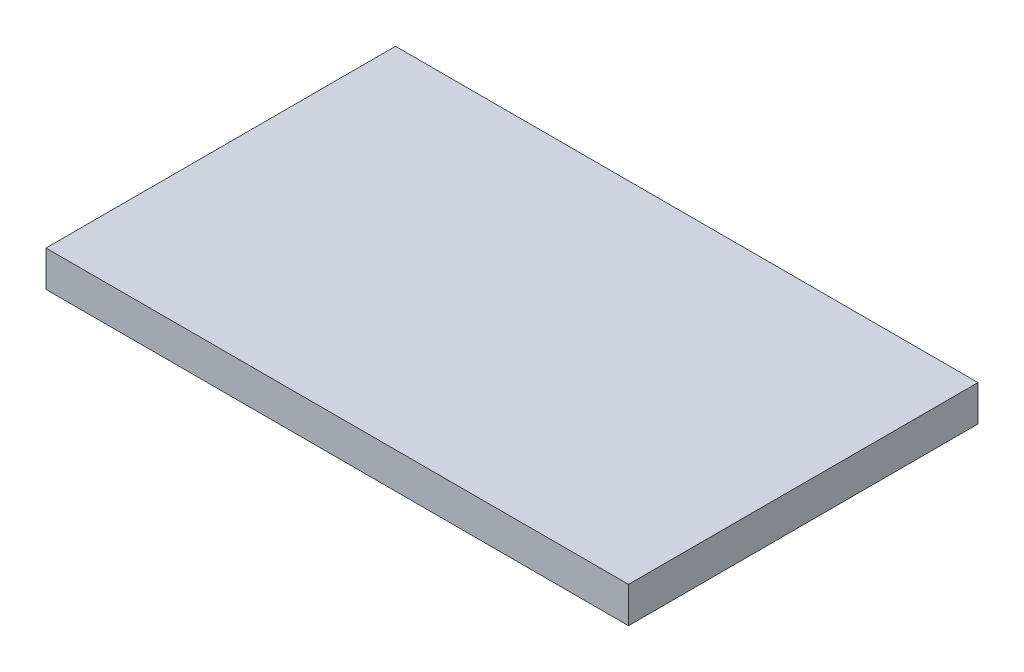
ISO-10303-21;
HEADER;
FILE_DESCRIPTION(('STEP AP214'),'2;1');
FILE_NAME('part.step','',(''),(''),'','','');
FILE_SCHEMA(('AUTOMOTIVE_DESIGN { 1 0 10303 214 1 1 1 1 }'));
ENDSEC;
DATA;
#1=APPLICATION_CONTEXT('core data for automotive mechanical design processes');
#2=APPLICATION_PROTOCOL_DEFINITION('international standard','automotive_design',2000,#1);
#3=PRODUCT_CONTEXT('',#1,'mechanical');
#4=PRODUCT('Part','Part','',(#3));
#5=PRODUCT_RELATED_PRODUCT_CATEGORY('part','',(#4));
#6=PRODUCT_DEFINITION_FORMATION('','',#4);
#7=PRODUCT_DEFINITION_CONTEXT('part definition',#1,'design');
#8=PRODUCT_DEFINITION('design','',#6,#7);
#9=PRODUCT_DEFINITION_SHAPE('','',#8);
#10=(LENGTH_UNIT() NAMED_UNIT(*) SI_UNIT(.MILLI.,.METRE.));
#11=(NAMED_UNIT(*) PLANE_ANGLE_UNIT() SI_UNIT($,.RADIAN.));
#12=(NAMED_UNIT(*) SI_UNIT($,.STERADIAN.) SOLID_ANGLE_UNIT());
#13=UNCERTAINTY_MEASURE_WITH_UNIT(LENGTH_MEASURE(1.E-05),#10,'distance_accuracy_value','');
#14=(GEOMETRIC_REPRESENTATION_CONTEXT(3) GLOBAL_UNCERTAINTY_ASSIGNED_CONTEXT((#13)) GLOBAL_UNIT_ASSIGNED_CONTEXT((#10,
#11,#12)) REPRESENTATION_CONTEXT('',''));
#15=CARTESIAN_POINT('',(0.,0.,0.));
#16=DIRECTION('',(0.,0.,1.));
#17=DIRECTION('',(1.,0.,0.));
#18=AXIS2_PLACEMENT_3D('',#15,#16,#17);
#19=CARTESIAN_POINT('',(16.25,2.,9.75));
#20=DIRECTION('',(-1.,0.,0.));
#21=DIRECTION('',(0.,0.,1.));
#22=AXIS2_PLACEMENT_3D('',#19,#20,#21);
#23=PLANE('',#22);
#24=DIRECTION('',(0.,0.,-1.));
#25=VECTOR('',#24,1.);
#26=CARTESIAN_POINT('',(16.25,0.,9.75));
#27=LINE('',#26,#25);
#28=CARTESIAN_POINT('',(16.25,0.,9.75));
#29=VERTEX_POINT('',#28);
#30=CARTESIAN_POINT('',(16.25,0.,-9.75));
#31=VERTEX_POINT('',#30);
#32=EDGE_CURVE('E96',#29,#31,#27,.T.);
#33=ORIENTED_EDGE('',*,*,#32,.T.);
#34=DIRECTION('',(0.,-1.,0.));
#35=VECTOR('',#34,1.);
#36=CARTESIAN_POINT('',(16.25,2.,-9.75));
#37=LINE('',#36,#35);
#38=CARTESIAN_POINT('',(16.25,2.,-9.75));
#39=VERTEX_POINT('',#38);
#40=EDGE_CURVE('E11',#39,#31,#37,.T.);
#41=ORIENTED_EDGE('',*,*,#40,.F.);
#42=DIRECTION('',(0.,0.,-1.));
#43=VECTOR('',#42,1.);
#44=CARTESIAN_POINT('',(16.25,2.,9.75));
#45=LINE('',#44,#43);
#46=CARTESIAN_POINT('',(16.25,2.,9.75));
#47=VERTEX_POINT('',#46);
#48=EDGE_CURVE('E84',#47,#39,#45,.T.);
#49=ORIENTED_EDGE('',*,*,#48,.F.);
#50=DIRECTION('',(0.,-1.,0.));
#51=VECTOR('',#50,1.);
#52=CARTESIAN_POINT('',(16.25,2.,9.75));
#53=LINE('',#52,#51);
#54=EDGE_CURVE('E92',#47,#29,#53,.T.);
#55=ORIENTED_EDGE('',*,*,#54,.T.);
#56=EDGE_LOOP('',(#33,#41,#49,#55));
#57=FACE_BOUND('',#56,.T.);
#58=ADVANCED_FACE('F33',(#57),#23,.F.);
#59=CARTESIAN_POINT('',(-16.25,2.,-9.75));
#60=DIRECTION('',(0.,0.,1.));
#61=DIRECTION('',(1.,0.,0.));
#62=AXIS2_PLACEMENT_3D('',#59,#60,#61);
#63=PLANE('',#62);
#64=DIRECTION('',(-1.,0.,0.));
#65=VECTOR('',#64,1.);
#66=CARTESIAN_POINT('',(-16.25,0.,-9.75));
#67=LINE('',#66,#65);
#68=CARTESIAN_POINT('',(-16.25,0.,-9.75));
#69=VERTEX_POINT('',#68);
#70=EDGE_CURVE('E88',#31,#69,#67,.T.);
#71=ORIENTED_EDGE('',*,*,#70,.T.);
#72=DIRECTION('',(0.,-1.,0.));
#73=VECTOR('',#72,1.);
#74=CARTESIAN_POINT('',(-16.25,2.,-9.75));
#75=LINE('',#74,#73);
#76=CARTESIAN_POINT('',(-16.25,2.,-9.75));
#77=VERTEX_POINT('',#76);
#78=EDGE_CURVE('E41',#77,#69,#75,.T.);
#79=ORIENTED_EDGE('',*,*,#78,.F.);
#80=DIRECTION('',(-1.,0.,0.));
#81=VECTOR('',#80,1.);
#82=CARTESIAN_POINT('',(-16.25,2.,-9.75));
#83=LINE('',#82,#81);
#84=EDGE_CURVE('E79',#39,#77,#83,.T.);
#85=ORIENTED_EDGE('',*,*,#84,.F.);
#86=ORIENTED_EDGE('',*,*,#40,.T.);
#87=EDGE_LOOP('',(#71,#79,#85,#86));
#88=FACE_BOUND('',#87,.T.);
#89=ADVANCED_FACE('F87',(#88),#63,.F.);
#90=CARTESIAN_POINT('',(-16.25,2.,9.75));
#91=DIRECTION('',(1.,0.,0.));
#92=DIRECTION('',(0.,0.,-1.));
#93=AXIS2_PLACEMENT_3D('',#90,#91,#92);
#94=PLANE('',#93);
#95=DIRECTION('',(0.,0.,1.));
#96=VECTOR('',#95,1.);
#97=CARTESIAN_POINT('',(-16.25,0.,9.75));
#98=LINE('',#97,#96);
#99=CARTESIAN_POINT('',(-16.25,0.,9.75));
#100=VERTEX_POINT('',#99);
#101=EDGE_CURVE('E66',#69,#100,#98,.T.);
#102=ORIENTED_EDGE('',*,*,#101,.T.);
#103=DIRECTION('',(0.,-1.,0.));
#104=VECTOR('',#103,1.);
#105=CARTESIAN_POINT('',(-16.25,2.,9.75));
#106=LINE('',#105,#104);
#107=CARTESIAN_POINT('',(-16.25,2.,9.75));
#108=VERTEX_POINT('',#107);
#109=EDGE_CURVE('E89',#108,#100,#106,.T.);
#110=ORIENTED_EDGE('',*,*,#109,.F.);
#111=DIRECTION('',(0.,0.,1.));
#112=VECTOR('',#111,1.);
#113=CARTESIAN_POINT('',(-16.25,2.,9.75));
#114=LINE('',#113,#112);
#115=EDGE_CURVE('E82',#77,#108,#114,.T.);
#116=ORIENTED_EDGE('',*,*,#115,.F.);
#117=ORIENTED_EDGE('',*,*,#78,.T.);
#118=EDGE_LOOP('',(#102,#110,#116,#117));
#119=FACE_BOUND('',#118,.T.);
#120=ADVANCED_FACE('F90',(#119),#94,.F.);
#121=CARTESIAN_POINT('',(-16.25,2.,9.75));
#122=DIRECTION('',(0.,0.,-1.));
#123=DIRECTION('',(-1.,0.,0.));
#124=AXIS2_PLACEMENT_3D('',#121,#122,#123);
#125=PLANE('',#124);
#126=DIRECTION('',(1.,0.,0.));
#127=VECTOR('',#126,1.);
#128=CARTESIAN_POINT('',(-16.25,0.,9.75));
#129=LINE('',#128,#127);
#130=EDGE_CURVE('E72',#100,#29,#129,.T.);
#131=ORIENTED_EDGE('',*,*,#130,.T.);
#132=ORIENTED_EDGE('',*,*,#54,.F.);
#133=DIRECTION('',(1.,0.,0.));
#134=VECTOR('',#133,1.);
#135=CARTESIAN_POINT('',(-16.25,2.,9.75));
#136=LINE('',#135,#134);
#137=EDGE_CURVE('E49',#108,#47,#136,.T.);
#138=ORIENTED_EDGE('',*,*,#137,.F.);
#139=ORIENTED_EDGE('',*,*,#109,.T.);
#140=EDGE_LOOP('',(#131,#132,#138,#139));
#141=FACE_BOUND('',#140,.T.);
#142=ADVANCED_FACE('F103',(#141),#125,.F.);
#143=CARTESIAN_POINT('',(0.,2.,0.));
#144=DIRECTION('',(0.,-1.,0.));
#145=DIRECTION('',(0.,0.,-1.));
#146=AXIS2_PLACEMENT_3D('',#143,#144,#145);
#147=PLANE('',#146);
#148=ORIENTED_EDGE('',*,*,#48,.T.);
#149=ORIENTED_EDGE('',*,*,#84,.T.);
#150=ORIENTED_EDGE('',*,*,#115,.T.);
#151=ORIENTED_EDGE('',*,*,#137,.T.);
#152=EDGE_LOOP('',(#148,#149,#150,#151));
#153=FACE_BOUND('',#152,.T.);
#154=ADVANCED_FACE('F80',(#153),#147,.F.);
#155=CARTESIAN_POINT('',(0.,0.,0.));
#156=DIRECTION('',(0.,-1.,0.));
#157=DIRECTION('',(0.,0.,-1.));
#158=AXIS2_PLACEMENT_3D('',#155,#156,#157);
#159=PLANE('',#158);
#160=ORIENTED_EDGE('',*,*,#32,.F.);
#161=ORIENTED_EDGE('',*,*,#130,.F.);
#162=ORIENTED_EDGE('',*,*,#101,.F.);
#163=ORIENTED_EDGE('',*,*,#70,.F.);
#164=EDGE_LOOP('',(#160,#161,#162,#163));
#165=FACE_BOUND('',#164,.T.);
#166=ADVANCED_FACE('F106',(#165),#159,.T.);
#167=CLOSED_SHELL('',(#58,#89,#120,#142,#154,#166));
#168=MANIFOLD_SOLID_BREP('B2',#167);
#169=ADVANCED_BREP_SHAPE_REPRESENTATION('',(#18,#168),#14);
#170=SHAPE_DEFINITION_REPRESENTATION(#9,#169);
ENDSEC;
END-ISO-10303-21;
